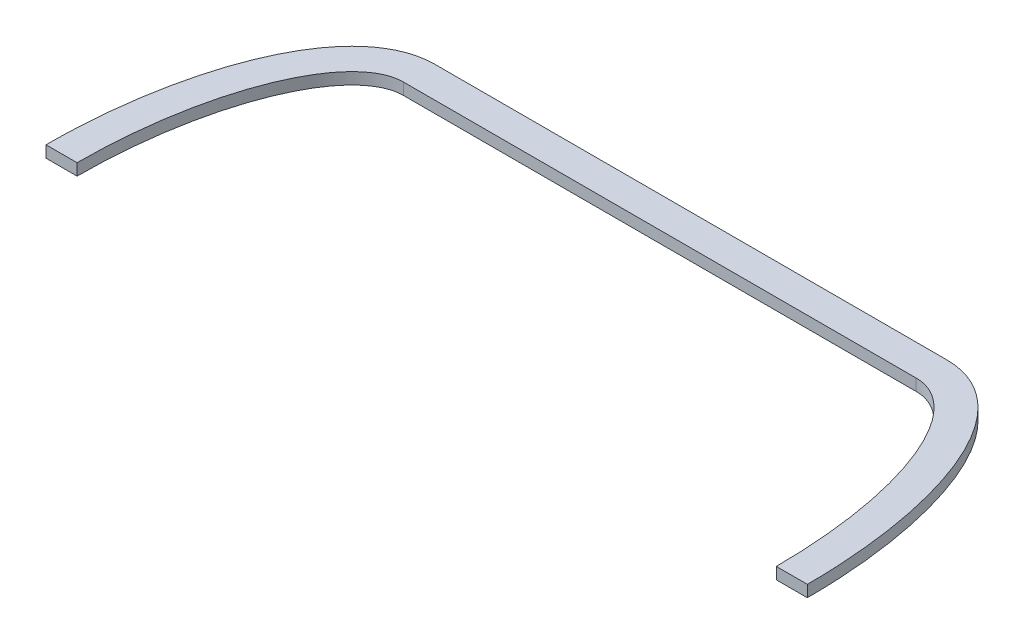
ISO-10303-21;
HEADER;
FILE_DESCRIPTION(('STEP AP214'),'2;1');
FILE_NAME('part.step','',(''),(''),'','','');
FILE_SCHEMA(('AUTOMOTIVE_DESIGN { 1 0 10303 214 1 1 1 1 }'));
ENDSEC;
DATA;
#1=APPLICATION_CONTEXT('core data for automotive mechanical design processes');
#2=APPLICATION_PROTOCOL_DEFINITION('international standard','automotive_design',2000,#1);
#3=PRODUCT_CONTEXT('',#1,'mechanical');
#4=PRODUCT('Part','Part','',(#3));
#5=PRODUCT_RELATED_PRODUCT_CATEGORY('part','',(#4));
#6=PRODUCT_DEFINITION_FORMATION('','',#4);
#7=PRODUCT_DEFINITION_CONTEXT('part definition',#1,'design');
#8=PRODUCT_DEFINITION('design','',#6,#7);
#9=PRODUCT_DEFINITION_SHAPE('','',#8);
#10=(LENGTH_UNIT() NAMED_UNIT(*) SI_UNIT(.MILLI.,.METRE.));
#11=(NAMED_UNIT(*) PLANE_ANGLE_UNIT() SI_UNIT($,.RADIAN.));
#12=(NAMED_UNIT(*) SI_UNIT($,.STERADIAN.) SOLID_ANGLE_UNIT());
#13=UNCERTAINTY_MEASURE_WITH_UNIT(LENGTH_MEASURE(1.E-05),#10,'distance_accuracy_value','');
#14=(GEOMETRIC_REPRESENTATION_CONTEXT(3) GLOBAL_UNCERTAINTY_ASSIGNED_CONTEXT((#13)) GLOBAL_UNIT_ASSIGNED_CONTEXT((#10,
#11,#12)) REPRESENTATION_CONTEXT('',''));
#15=CARTESIAN_POINT('',(0.,0.,0.));
#16=DIRECTION('',(0.,0.,1.));
#17=DIRECTION('',(1.,0.,0.));
#18=AXIS2_PLACEMENT_3D('',#15,#16,#17);
#19=CARTESIAN_POINT('',(-33.,1.5,0.));
#20=DIRECTION('',(0.,1.,0.));
#21=DIRECTION('',(0.,0.,1.));
#22=AXIS2_PLACEMENT_3D('',#19,#20,#21);
#23=ELLIPSE('',#22,30.,12.);
#24=DIRECTION('',(0.,-1.,0.));
#25=VECTOR('',#24,1.);
#26=SURFACE_OF_LINEAR_EXTRUSION('',#23,#25);
#27=OFFSET_SURFACE('',#26,-4.,.F.);
#28=DIRECTION('',(0.,-1.,0.));
#29=VECTOR('',#28,1.);
#30=CARTESIAN_POINT('',(-49.,0.75,0.));
#31=LINE('',#30,#29);
#32=CARTESIAN_POINT('',(-49.,1.5,0.));
#33=VERTEX_POINT('',#32);
#34=CARTESIAN_POINT('',(-49.,0.,0.));
#35=VERTEX_POINT('',#34);
#36=EDGE_CURVE('E116',#33,#35,#31,.T.);
#37=ORIENTED_EDGE('',*,*,#36,.F.);
#38=CARTESIAN_POINT('',(-33.,1.5,-34.));
#39=CARTESIAN_POINT('',(-33.1318594620977,1.5,-34.0000020599482));
#40=CARTESIAN_POINT('',(-33.2637006242787,1.5,-33.9970355341147));
#41=CARTESIAN_POINT('',(-33.5271110870535,1.5,-33.9851930390177));
#42=CARTESIAN_POINT('',(-33.6586804003457,1.5,-33.9763173523343));
#43=CARTESIAN_POINT('',(-34.0524260475535,1.5,-33.9408875606357));
#44=CARTESIAN_POINT('',(-34.3138623381053,1.5,-33.9055306264686));
#45=CARTESIAN_POINT('',(-34.8305964091808,1.5,-33.8123523725608));
#46=CARTESIAN_POINT('',(-35.0859257064015,1.5,-33.7547034487541));
#47=CARTESIAN_POINT('',(-35.5907917224365,1.5,-33.6179530744078));
#48=CARTESIAN_POINT('',(-35.8403278339926,1.5,-33.5388493858422));
#49=CARTESIAN_POINT('',(-36.3314711921855,1.5,-33.3607489952492));
#50=CARTESIAN_POINT('',(-36.573096455771,1.5,-33.2618017754368));
#51=CARTESIAN_POINT('',(-37.0479953394521,1.5,-33.0453975077983));
#52=CARTESIAN_POINT('',(-37.2812656129938,1.5,-32.9279331425494));
#53=CARTESIAN_POINT('',(-37.7388156571645,1.5,-32.6760332027823));
#54=CARTESIAN_POINT('',(-37.9630835644682,1.5,-32.5415761440126));
#55=CARTESIAN_POINT('',(-38.4018347424355,1.5,-32.2575102434145));
#56=CARTESIAN_POINT('',(-38.6163154961852,1.5,-32.1078975355798));
#57=CARTESIAN_POINT('',(-39.1532543402919,1.5,-31.7071041076178));
#58=CARTESIAN_POINT('',(-39.4684770078507,1.5,-31.4461846903361));
#59=CARTESIAN_POINT('',(-40.0745432389481,1.5,-30.8974107755337));
#60=CARTESIAN_POINT('',(-40.3653740258298,1.5,-30.6095423269061));
#61=CARTESIAN_POINT('',(-40.924294013386,1.5,-30.0114514760985));
#62=CARTESIAN_POINT('',(-41.1923320370166,1.5,-29.701181518627));
#63=CARTESIAN_POINT('',(-41.7066164563929,1.5,-29.0630483204643));
#64=CARTESIAN_POINT('',(-41.9528563480091,1.5,-28.7351798752964));
#65=CARTESIAN_POINT('',(-42.4712972529298,1.5,-28.0000642978313));
#66=CARTESIAN_POINT('',(-42.7392063418082,1.5,-27.5897993430692));
#67=CARTESIAN_POINT('',(-43.2494781947508,1.5,-26.7534139120122));
#68=CARTESIAN_POINT('',(-43.4918229407119,1.5,-26.3272825352882));
#69=CARTESIAN_POINT('',(-43.9535344011357,1.5,-25.4626566854945));
#70=CARTESIAN_POINT('',(-44.1728945430332,1.5,-25.0241587213834));
#71=CARTESIAN_POINT('',(-44.59130669948,1.5,-24.1366034231867));
#72=CARTESIAN_POINT('',(-44.7903190489005,1.5,-23.6875274883149));
#73=CARTESIAN_POINT('',(-45.1694966695557,1.5,-22.7817322494237));
#74=CARTESIAN_POINT('',(-45.3496694061485,1.5,-22.3250160567792));
#75=CARTESIAN_POINT('',(-45.6929528702929,1.5,-21.4052442104853));
#76=CARTESIAN_POINT('',(-45.856063669406,1.5,-20.942188583434));
#77=CARTESIAN_POINT('',(-46.1764891399855,1.5,-19.9813818243689));
#78=CARTESIAN_POINT('',(-46.3327822108289,1.5,-19.483290910703));
#79=CARTESIAN_POINT('',(-46.6291342184352,1.5,-18.4822739248874));
#80=CARTESIAN_POINT('',(-46.7691917170414,1.5,-17.9793474286655));
#81=CARTESIAN_POINT('',(-47.0343446224069,1.5,-16.9691716008346));
#82=CARTESIAN_POINT('',(-47.1594286517896,1.5,-16.461919291893));
#83=CARTESIAN_POINT('',(-47.3955073552352,1.5,-15.4441265624587));
#84=CARTESIAN_POINT('',(-47.5065012265865,1.5,-14.9335859563724));
#85=CARTESIAN_POINT('',(-47.7152506631777,1.5,-13.9096322212036));
#86=CARTESIAN_POINT('',(-47.8130017850487,1.5,-13.3962181878666));
#87=CARTESIAN_POINT('',(-47.9959021200888,1.5,-12.3671432744908));
#88=CARTESIAN_POINT('',(-48.0810508090306,1.5,-11.8514823019032));
#89=CARTESIAN_POINT('',(-48.3189822028628,1.5,-10.2983699369656));
#90=CARTESIAN_POINT('',(-48.453586223143,1.5,-9.25808852451466));
#91=CARTESIAN_POINT('',(-48.6777395263624,1.5,-7.17331636462823));
#92=CARTESIAN_POINT('',(-48.7673118072923,1.5,-6.12882804099582));
#93=CARTESIAN_POINT('',(-48.9035866922487,1.5,-4.03720573631824));
#94=CARTESIAN_POINT('',(-48.9502953565059,1.5,-2.99007215026959));
#95=CARTESIAN_POINT('',(-48.9979304608906,1.5,-1.05601569894444));
#96=CARTESIAN_POINT('',(-49.0047953518082,1.5,-0.169232157102556));
#97=CARTESIAN_POINT('',(-48.9886876788915,1.5,1.60419145579057));
#98=CARTESIAN_POINT('',(-48.9657111539563,1.5,2.49083149216792));
#99=CARTESIAN_POINT('',(-48.8895397901809,1.5,4.26308182212891));
#100=CARTESIAN_POINT('',(-48.8363359757705,1.5,5.14869173152721));
#101=CARTESIAN_POINT('',(-48.6987998662974,1.5,6.91798779564072));
#102=CARTESIAN_POINT('',(-48.614450737541,1.5,7.80167264959111));
#103=CARTESIAN_POINT('',(-48.4137441725008,1.5,9.56055225063439));
#104=CARTESIAN_POINT('',(-48.2975634838848,1.5,10.4357670281672));
#105=CARTESIAN_POINT('',(-48.0309519792693,1.5,12.1808466106661));
#106=CARTESIAN_POINT('',(-47.8805265524154,1.5,13.0507122353385));
#107=CARTESIAN_POINT('',(-47.5426449389393,1.5,14.7826673737946));
#108=CARTESIAN_POINT('',(-47.3552157164466,1.5,15.644762074639));
#109=CARTESIAN_POINT('',(-47.0433430253094,1.5,16.9300967030071));
#110=CARTESIAN_POINT('',(-46.9343030574677,1.5,17.3571074332168));
#111=CARTESIAN_POINT('',(-46.705323876174,1.5,18.2081897849636));
#112=CARTESIAN_POINT('',(-46.5853850963297,1.5,18.6322615227062));
#113=CARTESIAN_POINT('',(-46.3099613701162,1.5,19.5572920151293));
#114=CARTESIAN_POINT('',(-46.1520544438863,1.5,20.057533520389));
#115=CARTESIAN_POINT('',(-45.8183166797773,1.5,21.0519989533086));
#116=CARTESIAN_POINT('',(-45.642486626955,1.5,21.5462231434742));
#117=CARTESIAN_POINT('',(-45.2708565317141,1.5,22.5279730394365));
#118=CARTESIAN_POINT('',(-45.0750274579593,1.5,23.0154878072719));
#119=CARTESIAN_POINT('',(-44.661479868201,1.5,23.9811878173337));
#120=CARTESIAN_POINT('',(-44.44376152471,1.5,24.4593731330514));
#121=CARTESIAN_POINT('',(-43.981992283357,1.5,25.4077760171269));
#122=CARTESIAN_POINT('',(-43.7377404767102,1.5,25.8778963596938));
#123=CARTESIAN_POINT('',(-43.2212194112808,1.5,26.8027348642167));
#124=CARTESIAN_POINT('',(-42.9489444140762,1.5,27.2574498461149));
#125=CARTESIAN_POINT('',(-42.3735126923934,1.5,28.1456018489968));
#126=CARTESIAN_POINT('',(-42.0704261602621,1.5,28.5790840418468));
#127=CARTESIAN_POINT('',(-41.4291529915261,1.5,29.4192156910943));
#128=CARTESIAN_POINT('',(-41.0909897691264,1.5,29.8258827541572));
#129=CARTESIAN_POINT('',(-40.5278308199835,1.5,30.4385851206157));
#130=CARTESIAN_POINT('',(-40.3157240969554,1.5,30.6565141601795));
#131=CARTESIAN_POINT('',(-39.878127855667,1.5,31.0786383339111));
#132=CARTESIAN_POINT('',(-39.6526365904152,1.5,31.2828316677996));
#133=CARTESIAN_POINT('',(-39.1879603805882,1.5,31.6751775758266));
#134=CARTESIAN_POINT('',(-38.9487721248127,1.5,31.8633262436252));
#135=CARTESIAN_POINT('',(-38.4568919659684,1.5,32.2209113286117));
#136=CARTESIAN_POINT('',(-38.204205918611,1.5,32.390355763932));
#137=CARTESIAN_POINT('',(-37.6826037333005,1.5,32.7098471927893));
#138=CARTESIAN_POINT('',(-37.4135290937558,1.5,32.8596367230878));
#139=CARTESIAN_POINT('',(-36.8629856959038,1.5,33.1346097997704));
#140=CARTESIAN_POINT('',(-36.5815153949178,1.5,33.2597902728279));
#141=CARTESIAN_POINT('',(-36.0085391685868,1.5,33.4826454962346));
#142=CARTESIAN_POINT('',(-35.7170562164389,1.5,33.5803790342088));
#143=CARTESIAN_POINT('',(-35.125969633301,1.5,33.7463976127401));
#144=CARTESIAN_POINT('',(-34.8263712656585,1.5,33.8147012763248));
#145=CARTESIAN_POINT('',(-34.2725560161592,1.5,33.9114016006083));
#146=CARTESIAN_POINT('',(-34.0191717396856,1.5,33.9445750899428));
#147=CARTESIAN_POINT('',(-33.6377179083465,1.5,33.9778013169971));
#148=CARTESIAN_POINT('',(-33.5103278684717,1.5,33.986121061806));
#149=CARTESIAN_POINT('',(-33.2552966943805,1.5,33.9972218002038));
#150=CARTESIAN_POINT('',(-33.1276555410585,1.5,34.0000023546415));
#151=CARTESIAN_POINT('',(-33.,1.5,34.));
#152=B_SPLINE_CURVE_WITH_KNOTS('',3,(#38,#39,#40,#41,#42,#43,#44,#45,#46,#47,#48,#49,#50,#51,
#52,#53,#54,#55,#56,#57,#58,#59,#60,#61,#62,#63,#64,#65,#66,#67,#68,#69,#70,#71,#72,#73,#74,#75,
#76,#77,#78,#79,#80,#81,#82,#83,#84,#85,#86,#87,#88,#89,#90,#91,#92,#93,#94,#95,#96,#97,#98,#99,
#100,#101,#102,#103,#104,#105,#106,#107,#108,#109,#110,#111,#112,#113,#114,#115,#116,#117,#118,
#119,#120,#121,#122,#123,#124,#125,#126,#127,#128,#129,#130,#131,#132,#133,#134,#135,#136,#137,
#138,#139,#140,#141,#142,#143,#144,#145,#146,#147,#148,#149,#150,#151),.UNSPECIFIED.,.F.,.F.,(4,
2,2,2,2,2,2,2,2,2,2,2,2,2,2,2,2,2,2,2,2,2,2,2,2,2,2,2,2,2,2,2,2,2,2,2,2,2,2,2,2,2,2,2,2,2,2,2,2,
2,2,2,2,2,2,2,4),(0.,0.395508836014187,0.790998759870364,1.58131428167553,2.3656363114628,
3.15004018827493,3.93251185206918,4.71529350401624,5.49907493574531,6.28305680565762,
7.50867229476685,8.7349258126237,9.96386370828232,11.1931670672531,12.6620278715481,
14.1319171277453,15.6022255657429,17.0753476019005,18.5478836708645,20.0204135634422,
21.5862179857611,23.1521610021457,24.7192864253178,26.2865010870783,27.8542403042732,
29.4220447168738,32.5677400507569,35.7118272222425,38.8554698015129,41.5154187918589,
44.1757208955869,46.8368133519216,49.499346209299,52.147384676482,54.7950067056158,
57.4407065247341,58.7627261438731,60.0846931896487,61.6580971759044,63.231432274565,
64.8070846568383,66.3827246221411,67.9712586192657,69.5601185565721,71.1454367174265,
72.7297033832918,73.6415262024059,74.5534682982544,75.4656317913664,76.3774027270191,
77.3001263347647,78.2229651046637,79.1438119355043,80.0640752017713,80.8297204129566,
81.2125979873055,81.5955059152856),.UNSPECIFIED.);
#153=CARTESIAN_POINT('',(-33.,1.5,-34.));
#154=VERTEX_POINT('',#153);
#155=EDGE_CURVE('E125',#154,#33,#152,.T.);
#156=ORIENTED_EDGE('',*,*,#155,.F.);
#157=DIRECTION('',(0.,-1.,0.));
#158=VECTOR('',#157,1.);
#159=CARTESIAN_POINT('',(-33.,1.5,-34.));
#160=LINE('',#159,#158);
#161=CARTESIAN_POINT('',(-33.,0.,-34.));
#162=VERTEX_POINT('',#161);
#163=EDGE_CURVE('E171',#154,#162,#160,.T.);
#164=ORIENTED_EDGE('',*,*,#163,.T.);
#165=CARTESIAN_POINT('',(-33.,0.,-34.));
#166=CARTESIAN_POINT('',(-33.1318594620977,0.,-34.0000020599482));
#167=CARTESIAN_POINT('',(-33.2637006242787,0.,-33.9970355341147));
#168=CARTESIAN_POINT('',(-33.5271110870535,0.,-33.9851930390177));
#169=CARTESIAN_POINT('',(-33.6586804003457,0.,-33.9763173523343));
#170=CARTESIAN_POINT('',(-34.0524260475535,0.,-33.9408875606357));
#171=CARTESIAN_POINT('',(-34.3138623381053,0.,-33.9055306264686));
#172=CARTESIAN_POINT('',(-34.8305964091808,0.,-33.8123523725608));
#173=CARTESIAN_POINT('',(-35.0859257064015,0.,-33.7547034487541));
#174=CARTESIAN_POINT('',(-35.5907917224365,0.,-33.6179530744078));
#175=CARTESIAN_POINT('',(-35.8403278339926,0.,-33.5388493858422));
#176=CARTESIAN_POINT('',(-36.3314711921855,0.,-33.3607489952492));
#177=CARTESIAN_POINT('',(-36.573096455771,0.,-33.2618017754368));
#178=CARTESIAN_POINT('',(-37.0479953394521,0.,-33.0453975077983));
#179=CARTESIAN_POINT('',(-37.2812656129938,0.,-32.9279331425494));
#180=CARTESIAN_POINT('',(-37.7388156571645,0.,-32.6760332027823));
#181=CARTESIAN_POINT('',(-37.9630835644682,0.,-32.5415761440126));
#182=CARTESIAN_POINT('',(-38.4018347424355,0.,-32.2575102434145));
#183=CARTESIAN_POINT('',(-38.6163154961852,0.,-32.1078975355798));
#184=CARTESIAN_POINT('',(-39.1532543402919,0.,-31.7071041076178));
#185=CARTESIAN_POINT('',(-39.4684770078507,0.,-31.4461846903361));
#186=CARTESIAN_POINT('',(-40.0745432389481,0.,-30.8974107755337));
#187=CARTESIAN_POINT('',(-40.3653740258298,0.,-30.6095423269061));
#188=CARTESIAN_POINT('',(-40.924294013386,0.,-30.0114514760985));
#189=CARTESIAN_POINT('',(-41.1923320370166,0.,-29.701181518627));
#190=CARTESIAN_POINT('',(-41.7066164563929,0.,-29.0630483204643));
#191=CARTESIAN_POINT('',(-41.9528563480091,0.,-28.7351798752964));
#192=CARTESIAN_POINT('',(-42.4712972529298,0.,-28.0000642978313));
#193=CARTESIAN_POINT('',(-42.7392063418082,0.,-27.5897993430692));
#194=CARTESIAN_POINT('',(-43.2494781947508,0.,-26.7534139120122));
#195=CARTESIAN_POINT('',(-43.4918229407119,0.,-26.3272825352882));
#196=CARTESIAN_POINT('',(-43.9535344011357,0.,-25.4626566854945));
#197=CARTESIAN_POINT('',(-44.1728945430332,0.,-25.0241587213834));
#198=CARTESIAN_POINT('',(-44.59130669948,0.,-24.1366034231867));
#199=CARTESIAN_POINT('',(-44.7903190489005,0.,-23.6875274883149));
#200=CARTESIAN_POINT('',(-45.1694966695557,0.,-22.7817322494237));
#201=CARTESIAN_POINT('',(-45.3496694061485,0.,-22.3250160567792));
#202=CARTESIAN_POINT('',(-45.6929528702929,0.,-21.4052442104853));
#203=CARTESIAN_POINT('',(-45.856063669406,0.,-20.942188583434));
#204=CARTESIAN_POINT('',(-46.1764891399855,0.,-19.9813818243689));
#205=CARTESIAN_POINT('',(-46.3327822108289,0.,-19.483290910703));
#206=CARTESIAN_POINT('',(-46.6291342184352,0.,-18.4822739248874));
#207=CARTESIAN_POINT('',(-46.7691917170414,0.,-17.9793474286655));
#208=CARTESIAN_POINT('',(-47.0343446224069,0.,-16.9691716008346));
#209=CARTESIAN_POINT('',(-47.1594286517896,0.,-16.461919291893));
#210=CARTESIAN_POINT('',(-47.3955073552352,0.,-15.4441265624587));
#211=CARTESIAN_POINT('',(-47.5065012265865,0.,-14.9335859563724));
#212=CARTESIAN_POINT('',(-47.7152506631777,0.,-13.9096322212036));
#213=CARTESIAN_POINT('',(-47.8130017850487,0.,-13.3962181878666));
#214=CARTESIAN_POINT('',(-47.9959021200888,0.,-12.3671432744908));
#215=CARTESIAN_POINT('',(-48.0810508090306,0.,-11.8514823019032));
#216=CARTESIAN_POINT('',(-48.3189822028628,0.,-10.2983699369656));
#217=CARTESIAN_POINT('',(-48.453586223143,0.,-9.25808852451466));
#218=CARTESIAN_POINT('',(-48.6777395263624,0.,-7.17331636462823));
#219=CARTESIAN_POINT('',(-48.7673118072923,0.,-6.12882804099582));
#220=CARTESIAN_POINT('',(-48.9035866922487,0.,-4.03720573631824));
#221=CARTESIAN_POINT('',(-48.9502953565059,0.,-2.99007215026959));
#222=CARTESIAN_POINT('',(-48.9979304608906,0.,-1.05601569894444));
#223=CARTESIAN_POINT('',(-49.0047953518082,0.,-0.169232157102556));
#224=CARTESIAN_POINT('',(-48.9886876788915,0.,1.60419145579057));
#225=CARTESIAN_POINT('',(-48.9657111539563,0.,2.49083149216792));
#226=CARTESIAN_POINT('',(-48.8895397901809,0.,4.26308182212891));
#227=CARTESIAN_POINT('',(-48.8363359757705,0.,5.14869173152721));
#228=CARTESIAN_POINT('',(-48.6987998662974,0.,6.91798779564072));
#229=CARTESIAN_POINT('',(-48.614450737541,0.,7.80167264959111));
#230=CARTESIAN_POINT('',(-48.4137441725008,0.,9.56055225063439));
#231=CARTESIAN_POINT('',(-48.2975634838848,0.,10.4357670281672));
#232=CARTESIAN_POINT('',(-48.0309519792693,0.,12.1808466106661));
#233=CARTESIAN_POINT('',(-47.8805265524154,0.,13.0507122353385));
#234=CARTESIAN_POINT('',(-47.5426449389393,0.,14.7826673737946));
#235=CARTESIAN_POINT('',(-47.3552157164466,0.,15.644762074639));
#236=CARTESIAN_POINT('',(-47.0433430253094,0.,16.9300967030071));
#237=CARTESIAN_POINT('',(-46.9343030574677,0.,17.3571074332168));
#238=CARTESIAN_POINT('',(-46.705323876174,0.,18.2081897849636));
#239=CARTESIAN_POINT('',(-46.5853850963297,0.,18.6322615227062));
#240=CARTESIAN_POINT('',(-46.3099613701162,0.,19.5572920151293));
#241=CARTESIAN_POINT('',(-46.1520544438863,0.,20.057533520389));
#242=CARTESIAN_POINT('',(-45.8183166797773,0.,21.0519989533086));
#243=CARTESIAN_POINT('',(-45.642486626955,0.,21.5462231434742));
#244=CARTESIAN_POINT('',(-45.2708565317141,0.,22.5279730394365));
#245=CARTESIAN_POINT('',(-45.0750274579593,0.,23.0154878072719));
#246=CARTESIAN_POINT('',(-44.661479868201,0.,23.9811878173337));
#247=CARTESIAN_POINT('',(-44.44376152471,0.,24.4593731330514));
#248=CARTESIAN_POINT('',(-43.981992283357,0.,25.4077760171269));
#249=CARTESIAN_POINT('',(-43.7377404767102,0.,25.8778963596938));
#250=CARTESIAN_POINT('',(-43.2212194112808,0.,26.8027348642167));
#251=CARTESIAN_POINT('',(-42.9489444140762,0.,27.2574498461149));
#252=CARTESIAN_POINT('',(-42.3735126923934,0.,28.1456018489968));
#253=CARTESIAN_POINT('',(-42.0704261602621,0.,28.5790840418468));
#254=CARTESIAN_POINT('',(-41.4291529915261,0.,29.4192156910943));
#255=CARTESIAN_POINT('',(-41.0909897691264,0.,29.8258827541572));
#256=CARTESIAN_POINT('',(-40.5278308199835,0.,30.4385851206157));
#257=CARTESIAN_POINT('',(-40.3157240969554,0.,30.6565141601795));
#258=CARTESIAN_POINT('',(-39.878127855667,0.,31.0786383339111));
#259=CARTESIAN_POINT('',(-39.6526365904152,0.,31.2828316677996));
#260=CARTESIAN_POINT('',(-39.1879603805882,0.,31.6751775758266));
#261=CARTESIAN_POINT('',(-38.9487721248127,0.,31.8633262436252));
#262=CARTESIAN_POINT('',(-38.4568919659684,0.,32.2209113286117));
#263=CARTESIAN_POINT('',(-38.204205918611,0.,32.390355763932));
#264=CARTESIAN_POINT('',(-37.6826037333005,0.,32.7098471927893));
#265=CARTESIAN_POINT('',(-37.4135290937558,0.,32.8596367230878));
#266=CARTESIAN_POINT('',(-36.8629856959038,0.,33.1346097997704));
#267=CARTESIAN_POINT('',(-36.5815153949178,0.,33.2597902728279));
#268=CARTESIAN_POINT('',(-36.0085391685868,0.,33.4826454962346));
#269=CARTESIAN_POINT('',(-35.7170562164389,0.,33.5803790342088));
#270=CARTESIAN_POINT('',(-35.125969633301,0.,33.7463976127401));
#271=CARTESIAN_POINT('',(-34.8263712656585,0.,33.8147012763248));
#272=CARTESIAN_POINT('',(-34.2725560161592,0.,33.9114016006083));
#273=CARTESIAN_POINT('',(-34.0191717396856,0.,33.9445750899428));
#274=CARTESIAN_POINT('',(-33.6377179083465,0.,33.9778013169971));
#275=CARTESIAN_POINT('',(-33.5103278684717,0.,33.986121061806));
#276=CARTESIAN_POINT('',(-33.2552966943805,0.,33.9972218002038));
#277=CARTESIAN_POINT('',(-33.1276555410585,0.,34.0000023546415));
#278=CARTESIAN_POINT('',(-33.,0.,34.));
#279=B_SPLINE_CURVE_WITH_KNOTS('',3,(#165,#166,#167,#168,#169,#170,#171,#172,#173,#174,#175,
#176,#177,#178,#179,#180,#181,#182,#183,#184,#185,#186,#187,#188,#189,#190,#191,#192,#193,#194,
#195,#196,#197,#198,#199,#200,#201,#202,#203,#204,#205,#206,#207,#208,#209,#210,#211,#212,#213,
#214,#215,#216,#217,#218,#219,#220,#221,#222,#223,#224,#225,#226,#227,#228,#229,#230,#231,#232,
#233,#234,#235,#236,#237,#238,#239,#240,#241,#242,#243,#244,#245,#246,#247,#248,#249,#250,#251,
#252,#253,#254,#255,#256,#257,#258,#259,#260,#261,#262,#263,#264,#265,#266,#267,#268,#269,#270,
#271,#272,#273,#274,#275,#276,#277,#278),.UNSPECIFIED.,.F.,.F.,(4,2,2,2,2,2,2,2,2,2,2,2,2,2,2,2,
2,2,2,2,2,2,2,2,2,2,2,2,2,2,2,2,2,2,2,2,2,2,2,2,2,2,2,2,2,2,2,2,2,2,2,2,2,2,2,2,4),(0.,
0.395508836014187,0.790998759870364,1.58131428167553,2.3656363114628,3.15004018827493,
3.93251185206918,4.71529350401624,5.49907493574531,6.28305680565762,7.50867229476685,
8.7349258126237,9.96386370828232,11.1931670672531,12.6620278715481,14.1319171277453,
15.6022255657429,17.0753476019005,18.5478836708645,20.0204135634422,21.5862179857611,
23.1521610021457,24.7192864253178,26.2865010870783,27.8542403042732,29.4220447168738,
32.5677400507569,35.7118272222425,38.8554698015129,41.5154187918589,44.1757208955869,
46.8368133519216,49.499346209299,52.147384676482,54.7950067056158,57.4407065247341,
58.7627261438731,60.0846931896487,61.6580971759044,63.231432274565,64.8070846568383,
66.3827246221411,67.9712586192657,69.5601185565721,71.1454367174265,72.7297033832918,
73.6415262024059,74.5534682982544,75.4656317913664,76.3774027270191,77.3001263347647,
78.2229651046637,79.1438119355043,80.0640752017713,80.8297204129566,81.2125979873055,
81.5955059152856),.UNSPECIFIED.);
#280=EDGE_CURVE('E123',#162,#35,#279,.T.);
#281=ORIENTED_EDGE('',*,*,#280,.T.);
#282=EDGE_LOOP('',(#37,#156,#164,#281));
#283=FACE_BOUND('',#282,.T.);
#284=ADVANCED_FACE('F36',(#283),#27,.F.);
#285=CARTESIAN_POINT('',(33.,1.5,0.));
#286=DIRECTION('',(0.,-1.,0.));
#287=DIRECTION('',(0.,0.,1.));
#288=AXIS2_PLACEMENT_3D('',#285,#286,#287);
#289=ELLIPSE('',#288,30.,12.);
#290=DIRECTION('',(0.,-1.,0.));
#291=VECTOR('',#290,1.);
#292=SURFACE_OF_LINEAR_EXTRUSION('',#289,#291);
#293=OFFSET_SURFACE('',#292,4.,.F.);
#294=CARTESIAN_POINT('',(33.,1.5,-34.));
#295=CARTESIAN_POINT('',(33.1318594620977,1.5,-34.0000020599482));
#296=CARTESIAN_POINT('',(33.2637006242787,1.5,-33.9970355341147));
#297=CARTESIAN_POINT('',(33.5271110870536,1.5,-33.9851930390177));
#298=CARTESIAN_POINT('',(33.6586804003457,1.5,-33.9763173523343));
#299=CARTESIAN_POINT('',(34.0524260475535,1.5,-33.9408875606357));
#300=CARTESIAN_POINT('',(34.3138623381053,1.5,-33.9055306264686));
#301=CARTESIAN_POINT('',(34.8305964091809,1.5,-33.8123523725608));
#302=CARTESIAN_POINT('',(35.0859257064015,1.5,-33.7547034487541));
#303=CARTESIAN_POINT('',(35.5907917224366,1.5,-33.6179530744078));
#304=CARTESIAN_POINT('',(35.8403278339927,1.5,-33.5388493858422));
#305=CARTESIAN_POINT('',(36.3314711921855,1.5,-33.3607489952492));
#306=CARTESIAN_POINT('',(36.573096455771,1.5,-33.2618017754368));
#307=CARTESIAN_POINT('',(37.0479953394522,1.5,-33.0453975077983));
#308=CARTESIAN_POINT('',(37.2812656129938,1.5,-32.9279331425494));
#309=CARTESIAN_POINT('',(37.7388156571646,1.5,-32.6760332027822));
#310=CARTESIAN_POINT('',(37.9630835644682,1.5,-32.5415761440126));
#311=CARTESIAN_POINT('',(38.4018347424356,1.5,-32.2575102434144));
#312=CARTESIAN_POINT('',(38.6163154961852,1.5,-32.1078975355798));
#313=CARTESIAN_POINT('',(39.1532543402919,1.5,-31.7071041076178));
#314=CARTESIAN_POINT('',(39.4684770078507,1.5,-31.446184690336));
#315=CARTESIAN_POINT('',(40.0745432389481,1.5,-30.8974107755336));
#316=CARTESIAN_POINT('',(40.3653740258299,1.5,-30.6095423269061));
#317=CARTESIAN_POINT('',(40.9242940133861,1.5,-30.0114514760985));
#318=CARTESIAN_POINT('',(41.1923320370166,1.5,-29.7011815186269));
#319=CARTESIAN_POINT('',(41.706616456393,1.5,-29.0630483204643));
#320=CARTESIAN_POINT('',(41.9528563480091,1.5,-28.7351798752963));
#321=CARTESIAN_POINT('',(42.4712972529298,1.5,-28.0000642978313));
#322=CARTESIAN_POINT('',(42.7392063418083,1.5,-27.5897993430691));
#323=CARTESIAN_POINT('',(43.2494781947508,1.5,-26.7534139120122));
#324=CARTESIAN_POINT('',(43.4918229407119,1.5,-26.3272825352881));
#325=CARTESIAN_POINT('',(43.9535344011357,1.5,-25.4626566854944));
#326=CARTESIAN_POINT('',(44.1728945430332,1.5,-25.0241587213833));
#327=CARTESIAN_POINT('',(44.5913066994801,1.5,-24.1366034231866));
#328=CARTESIAN_POINT('',(44.7903190489005,1.5,-23.6875274883148));
#329=CARTESIAN_POINT('',(45.1694966695558,1.5,-22.7817322494236));
#330=CARTESIAN_POINT('',(45.3496694061486,1.5,-22.3250160567791));
#331=CARTESIAN_POINT('',(45.692952870293,1.5,-21.4052442104852));
#332=CARTESIAN_POINT('',(45.8560636694061,1.5,-20.9421885834339));
#333=CARTESIAN_POINT('',(46.1764891399856,1.5,-19.9813818243687));
#334=CARTESIAN_POINT('',(46.332782210829,1.5,-19.4832909107029));
#335=CARTESIAN_POINT('',(46.6291342184352,1.5,-18.4822739248873));
#336=CARTESIAN_POINT('',(46.7691917170415,1.5,-17.9793474286653));
#337=CARTESIAN_POINT('',(47.034344622407,1.5,-16.9691716008345));
#338=CARTESIAN_POINT('',(47.1594286517897,1.5,-16.4619192918928));
#339=CARTESIAN_POINT('',(47.3955073552353,1.5,-15.4441265624586));
#340=CARTESIAN_POINT('',(47.5065012265866,1.5,-14.9335859563722));
#341=CARTESIAN_POINT('',(47.7152506631777,1.5,-13.9096322212035));
#342=CARTESIAN_POINT('',(47.8130017850488,1.5,-13.3962181878665));
#343=CARTESIAN_POINT('',(47.9959021200888,1.5,-12.3671432744906));
#344=CARTESIAN_POINT('',(48.0810508090306,1.5,-11.851482301903));
#345=CARTESIAN_POINT('',(48.3189822028629,1.5,-10.2983699369654));
#346=CARTESIAN_POINT('',(48.453586223143,1.5,-9.25808852451447));
#347=CARTESIAN_POINT('',(48.6777395263624,1.5,-7.17331636462802));
#348=CARTESIAN_POINT('',(48.7673118072923,1.5,-6.12882804099561));
#349=CARTESIAN_POINT('',(48.9035866922487,1.5,-4.03720573631802));
#350=CARTESIAN_POINT('',(48.9502953565059,1.5,-2.99007215026935));
#351=CARTESIAN_POINT('',(48.9979304608906,1.5,-1.0560156989442));
#352=CARTESIAN_POINT('',(49.0047953518082,1.5,-0.169232157102302));
#353=CARTESIAN_POINT('',(48.9886876788915,1.5,1.60419145579083));
#354=CARTESIAN_POINT('',(48.9657111539563,1.5,2.4908314921682));
#355=CARTESIAN_POINT('',(48.8895397901809,1.5,4.26308182212921));
#356=CARTESIAN_POINT('',(48.8363359757705,1.5,5.1486917315275));
#357=CARTESIAN_POINT('',(48.6987998662973,1.5,6.91798779564103));
#358=CARTESIAN_POINT('',(48.614450737541,1.5,7.80167264959143));
#359=CARTESIAN_POINT('',(48.4137441725008,1.5,9.56055225063472));
#360=CARTESIAN_POINT('',(48.2975634838848,1.5,10.4357670281675));
#361=CARTESIAN_POINT('',(48.0309519792692,1.5,12.1808466106664));
#362=CARTESIAN_POINT('',(47.8805265524154,1.5,13.0507122353389));
#363=CARTESIAN_POINT('',(47.5426449389392,1.5,14.782667373795));
#364=CARTESIAN_POINT('',(47.3552157164465,1.5,15.6447620746394));
#365=CARTESIAN_POINT('',(47.0433430253093,1.5,16.9300967030075));
#366=CARTESIAN_POINT('',(46.9343030574676,1.5,17.3571074332172));
#367=CARTESIAN_POINT('',(46.7053238761739,1.5,18.208189784964));
#368=CARTESIAN_POINT('',(46.5853850963296,1.5,18.6322615227066));
#369=CARTESIAN_POINT('',(46.3099613701161,1.5,19.5572920151297));
#370=CARTESIAN_POINT('',(46.1520544438862,1.5,20.0575335203894));
#371=CARTESIAN_POINT('',(45.8183166797772,1.5,21.0519989533089));
#372=CARTESIAN_POINT('',(45.6424866269549,1.5,21.5462231434745));
#373=CARTESIAN_POINT('',(45.270856531714,1.5,22.5279730394369));
#374=CARTESIAN_POINT('',(45.0750274579591,1.5,23.0154878072722));
#375=CARTESIAN_POINT('',(44.6614798682008,1.5,23.981187817334));
#376=CARTESIAN_POINT('',(44.4437615247099,1.5,24.4593731330517));
#377=CARTESIAN_POINT('',(43.9819922833569,1.5,25.4077760171272));
#378=CARTESIAN_POINT('',(43.7377404767101,1.5,25.8778963596941));
#379=CARTESIAN_POINT('',(43.2212194112807,1.5,26.802734864217));
#380=CARTESIAN_POINT('',(42.9489444140761,1.5,27.2574498461151));
#381=CARTESIAN_POINT('',(42.3735126923932,1.5,28.145601848997));
#382=CARTESIAN_POINT('',(42.0704261602619,1.5,28.579084041847));
#383=CARTESIAN_POINT('',(41.429152991526,1.5,29.4192156910945));
#384=CARTESIAN_POINT('',(41.0909897691263,1.5,29.8258827541573));
#385=CARTESIAN_POINT('',(40.5278308199834,1.5,30.4385851206158));
#386=CARTESIAN_POINT('',(40.3157240969553,1.5,30.6565141601796));
#387=CARTESIAN_POINT('',(39.8781278556668,1.5,31.0786383339112));
#388=CARTESIAN_POINT('',(39.6526365904151,1.5,31.2828316677998));
#389=CARTESIAN_POINT('',(39.1879603805881,1.5,31.6751775758267));
#390=CARTESIAN_POINT('',(38.9487721248125,1.5,31.8633262436253));
#391=CARTESIAN_POINT('',(38.4568919659683,1.5,32.2209113286118));
#392=CARTESIAN_POINT('',(38.2042059186109,1.5,32.390355763932));
#393=CARTESIAN_POINT('',(37.6826037333004,1.5,32.7098471927894));
#394=CARTESIAN_POINT('',(37.4135290937557,1.5,32.8596367230879));
#395=CARTESIAN_POINT('',(36.8629856959037,1.5,33.1346097997705));
#396=CARTESIAN_POINT('',(36.5815153949177,1.5,33.259790272828));
#397=CARTESIAN_POINT('',(36.0085391685867,1.5,33.4826454962346));
#398=CARTESIAN_POINT('',(35.7170562164388,1.5,33.5803790342089));
#399=CARTESIAN_POINT('',(35.1259696333009,1.5,33.7463976127401));
#400=CARTESIAN_POINT('',(34.8263712656584,1.5,33.8147012763248));
#401=CARTESIAN_POINT('',(34.2725560161592,1.5,33.9114016006083));
#402=CARTESIAN_POINT('',(34.0191717396855,1.5,33.9445750899428));
#403=CARTESIAN_POINT('',(33.6377179083464,1.5,33.9778013169971));
#404=CARTESIAN_POINT('',(33.5103278684717,1.5,33.986121061806));
#405=CARTESIAN_POINT('',(33.2552966943805,1.5,33.9972218002038));
#406=CARTESIAN_POINT('',(33.1276555410585,1.5,34.0000023546415));
#407=CARTESIAN_POINT('',(33.,1.5,34.));
#408=B_SPLINE_CURVE_WITH_KNOTS('',3,(#294,#295,#296,#297,#298,#299,#300,#301,#302,#303,#304,
#305,#306,#307,#308,#309,#310,#311,#312,#313,#314,#315,#316,#317,#318,#319,#320,#321,#322,#323,
#324,#325,#326,#327,#328,#329,#330,#331,#332,#333,#334,#335,#336,#337,#338,#339,#340,#341,#342,
#343,#344,#345,#346,#347,#348,#349,#350,#351,#352,#353,#354,#355,#356,#357,#358,#359,#360,#361,
#362,#363,#364,#365,#366,#367,#368,#369,#370,#371,#372,#373,#374,#375,#376,#377,#378,#379,#380,
#381,#382,#383,#384,#385,#386,#387,#388,#389,#390,#391,#392,#393,#394,#395,#396,#397,#398,#399,
#400,#401,#402,#403,#404,#405,#406,#407),.UNSPECIFIED.,.F.,.F.,(4,2,2,2,2,2,2,2,2,2,2,2,2,2,2,2,
2,2,2,2,2,2,2,2,2,2,2,2,2,2,2,2,2,2,2,2,2,2,2,2,2,2,2,2,2,2,2,2,2,2,2,2,2,2,2,2,4),(0.,
0.395508836014194,0.790998759870364,1.58131428167553,2.3656363114628,3.15004018827493,
3.93251185206919,4.71529350401626,5.49907493574532,6.28305680565762,7.50867229476686,
8.73492581262373,9.96386370828235,11.1931670672532,12.6620278715481,14.1319171277453,
15.6022255657429,17.0753476019006,18.5478836708646,20.0204135634424,21.5862179857612,
23.1521610021458,24.719286425318,26.2865010870785,27.8542403042734,29.422044716874,
32.5677400507571,35.7118272222427,38.8554698015131,41.5154187918592,44.1757208955872,
46.8368133519219,49.4993462092993,52.1473846764823,54.7950067056161,57.4407065247345,
58.7627261438735,60.0846931896491,61.6580971759048,63.2314322745653,64.8070846568386,
66.3827246221414,67.9712586192659,69.5601185565723,71.1454367174267,72.729703383292,
73.6415262024061,74.5534682982545,75.4656317913666,76.3774027270192,77.3001263347648,
78.2229651046638,79.1438119355044,80.0640752017714,80.8297204129567,81.2125979873055,
81.5955059152856),.UNSPECIFIED.);
#409=CARTESIAN_POINT('',(33.,1.5,-34.));
#410=VERTEX_POINT('',#409);
#411=CARTESIAN_POINT('',(49.,1.5,0.));
#412=VERTEX_POINT('',#411);
#413=EDGE_CURVE('E115',#410,#412,#408,.T.);
#414=ORIENTED_EDGE('',*,*,#413,.T.);
#415=DIRECTION('',(0.,-1.,0.));
#416=VECTOR('',#415,1.);
#417=CARTESIAN_POINT('',(49.,0.75,0.));
#418=LINE('',#417,#416);
#419=CARTESIAN_POINT('',(49.,0.,0.));
#420=VERTEX_POINT('',#419);
#421=EDGE_CURVE('E101',#412,#420,#418,.T.);
#422=ORIENTED_EDGE('',*,*,#421,.T.);
#423=CARTESIAN_POINT('',(33.,0.,-34.));
#424=CARTESIAN_POINT('',(33.1318594620977,0.,-34.0000020599482));
#425=CARTESIAN_POINT('',(33.2637006242787,0.,-33.9970355341147));
#426=CARTESIAN_POINT('',(33.5271110870536,0.,-33.9851930390177));
#427=CARTESIAN_POINT('',(33.6586804003457,0.,-33.9763173523343));
#428=CARTESIAN_POINT('',(34.0524260475535,0.,-33.9408875606357));
#429=CARTESIAN_POINT('',(34.3138623381053,0.,-33.9055306264686));
#430=CARTESIAN_POINT('',(34.8305964091809,0.,-33.8123523725608));
#431=CARTESIAN_POINT('',(35.0859257064015,0.,-33.7547034487541));
#432=CARTESIAN_POINT('',(35.5907917224365,0.,-33.6179530744078));
#433=CARTESIAN_POINT('',(35.8403278339926,0.,-33.5388493858422));
#434=CARTESIAN_POINT('',(36.3314711921855,0.,-33.3607489952492));
#435=CARTESIAN_POINT('',(36.573096455771,0.,-33.2618017754368));
#436=CARTESIAN_POINT('',(37.0479953394521,0.,-33.0453975077983));
#437=CARTESIAN_POINT('',(37.2812656129938,0.,-32.9279331425494));
#438=CARTESIAN_POINT('',(37.7388156571646,0.,-32.6760332027823));
#439=CARTESIAN_POINT('',(37.9630835644682,0.,-32.5415761440126));
#440=CARTESIAN_POINT('',(38.4018347424355,0.,-32.2575102434145));
#441=CARTESIAN_POINT('',(38.6163154961852,0.,-32.1078975355798));
#442=CARTESIAN_POINT('',(39.1532543402919,0.,-31.7071041076179));
#443=CARTESIAN_POINT('',(39.4684770078507,0.,-31.4461846903361));
#444=CARTESIAN_POINT('',(40.0745432389481,0.,-30.8974107755337));
#445=CARTESIAN_POINT('',(40.3653740258299,0.,-30.6095423269061));
#446=CARTESIAN_POINT('',(40.924294013386,0.,-30.0114514760985));
#447=CARTESIAN_POINT('',(41.1923320370166,0.,-29.701181518627));
#448=CARTESIAN_POINT('',(41.7066164563929,0.,-29.0630483204643));
#449=CARTESIAN_POINT('',(41.9528563480091,0.,-28.7351798752964));
#450=CARTESIAN_POINT('',(42.4712972529298,0.,-28.0000642978313));
#451=CARTESIAN_POINT('',(42.7392063418082,0.,-27.5897993430692));
#452=CARTESIAN_POINT('',(43.2494781947508,0.,-26.7534139120122));
#453=CARTESIAN_POINT('',(43.4918229407119,0.,-26.3272825352882));
#454=CARTESIAN_POINT('',(43.9535344011357,0.,-25.4626566854945));
#455=CARTESIAN_POINT('',(44.1728945430332,0.,-25.0241587213833));
#456=CARTESIAN_POINT('',(44.59130669948,0.,-24.1366034231867));
#457=CARTESIAN_POINT('',(44.7903190489005,0.,-23.6875274883149));
#458=CARTESIAN_POINT('',(45.1694966695557,0.,-22.7817322494237));
#459=CARTESIAN_POINT('',(45.3496694061486,0.,-22.3250160567792));
#460=CARTESIAN_POINT('',(45.692952870293,0.,-21.4052442104853));
#461=CARTESIAN_POINT('',(45.856063669406,0.,-20.942188583434));
#462=CARTESIAN_POINT('',(46.1764891399855,0.,-19.9813818243688));
#463=CARTESIAN_POINT('',(46.3327822108289,0.,-19.483290910703));
#464=CARTESIAN_POINT('',(46.6291342184352,0.,-18.4822739248874));
#465=CARTESIAN_POINT('',(46.7691917170415,0.,-17.9793474286654));
#466=CARTESIAN_POINT('',(47.0343446224069,0.,-16.9691716008346));
#467=CARTESIAN_POINT('',(47.1594286517896,0.,-16.4619192918929));
#468=CARTESIAN_POINT('',(47.3955073552352,0.,-15.4441265624587));
#469=CARTESIAN_POINT('',(47.5065012265866,0.,-14.9335859563723));
#470=CARTESIAN_POINT('',(47.7152506631777,0.,-13.9096322212036));
#471=CARTESIAN_POINT('',(47.8130017850488,0.,-13.3962181878666));
#472=CARTESIAN_POINT('',(47.9959021200888,0.,-12.3671432744907));
#473=CARTESIAN_POINT('',(48.0810508090306,0.,-11.8514823019032));
#474=CARTESIAN_POINT('',(48.3189822028628,0.,-10.2983699369656));
#475=CARTESIAN_POINT('',(48.453586223143,0.,-9.25808852451462));
#476=CARTESIAN_POINT('',(48.6777395263624,0.,-7.17331636462818));
#477=CARTESIAN_POINT('',(48.7673118072923,0.,-6.12882804099578));
#478=CARTESIAN_POINT('',(48.9035866922487,0.,-4.0372057363182));
#479=CARTESIAN_POINT('',(48.9502953565059,0.,-2.99007215026955));
#480=CARTESIAN_POINT('',(48.9979304608906,0.,-1.0560156989444));
#481=CARTESIAN_POINT('',(49.0047953518082,0.,-0.169232157102506));
#482=CARTESIAN_POINT('',(48.9886876788916,0.,1.60419145579062));
#483=CARTESIAN_POINT('',(48.9657111539564,0.,2.49083149216798));
#484=CARTESIAN_POINT('',(48.8895397901809,0.,4.26308182212898));
#485=CARTESIAN_POINT('',(48.8363359757705,0.,5.14869173152728));
#486=CARTESIAN_POINT('',(48.6987998662973,0.,6.9179877956408));
#487=CARTESIAN_POINT('',(48.614450737541,0.,7.80167264959119));
#488=CARTESIAN_POINT('',(48.4137441725009,0.,9.56055225063447));
#489=CARTESIAN_POINT('',(48.2975634838848,0.,10.4357670281673));
#490=CARTESIAN_POINT('',(48.0309519792693,0.,12.1808466106661));
#491=CARTESIAN_POINT('',(47.8805265524154,0.,13.0507122353386));
#492=CARTESIAN_POINT('',(47.5426449389393,0.,14.7826673737947));
#493=CARTESIAN_POINT('',(47.3552157164466,0.,15.6447620746391));
#494=CARTESIAN_POINT('',(47.0433430253094,0.,16.9300967030072));
#495=CARTESIAN_POINT('',(46.9343030574677,0.,17.3571074332169));
#496=CARTESIAN_POINT('',(46.7053238761739,0.,18.2081897849637));
#497=CARTESIAN_POINT('',(46.5853850963297,0.,18.6322615227063));
#498=CARTESIAN_POINT('',(46.3099613701162,0.,19.5572920151294));
#499=CARTESIAN_POINT('',(46.1520544438863,0.,20.0575335203891));
#500=CARTESIAN_POINT('',(45.8183166797773,0.,21.0519989533087));
#501=CARTESIAN_POINT('',(45.642486626955,0.,21.5462231434743));
#502=CARTESIAN_POINT('',(45.2708565317141,0.,22.5279730394366));
#503=CARTESIAN_POINT('',(45.0750274579592,0.,23.015487807272));
#504=CARTESIAN_POINT('',(44.6614798682009,0.,23.9811878173337));
#505=CARTESIAN_POINT('',(44.44376152471,0.,24.4593731330515));
#506=CARTESIAN_POINT('',(43.981992283357,0.,25.407776017127));
#507=CARTESIAN_POINT('',(43.7377404767102,0.,25.8778963596939));
#508=CARTESIAN_POINT('',(43.2212194112808,0.,26.8027348642168));
#509=CARTESIAN_POINT('',(42.9489444140762,0.,27.2574498461149));
#510=CARTESIAN_POINT('',(42.3735126923933,0.,28.1456018489968));
#511=CARTESIAN_POINT('',(42.070426160262,0.,28.5790840418468));
#512=CARTESIAN_POINT('',(41.4291529915261,0.,29.4192156910944));
#513=CARTESIAN_POINT('',(41.0909897691264,0.,29.8258827541572));
#514=CARTESIAN_POINT('',(40.5278308199835,0.,30.4385851206157));
#515=CARTESIAN_POINT('',(40.3157240969554,0.,30.6565141601796));
#516=CARTESIAN_POINT('',(39.8781278556669,0.,31.0786383339112));
#517=CARTESIAN_POINT('',(39.6526365904152,0.,31.2828316677997));
#518=CARTESIAN_POINT('',(39.1879603805882,0.,31.6751775758266));
#519=CARTESIAN_POINT('',(38.9487721248126,0.,31.8633262436252));
#520=CARTESIAN_POINT('',(38.4568919659684,0.,32.2209113286118));
#521=CARTESIAN_POINT('',(38.204205918611,0.,32.390355763932));
#522=CARTESIAN_POINT('',(37.6826037333005,0.,32.7098471927894));
#523=CARTESIAN_POINT('',(37.4135290937558,0.,32.8596367230878));
#524=CARTESIAN_POINT('',(36.8629856959038,0.,33.1346097997704));
#525=CARTESIAN_POINT('',(36.5815153949178,0.,33.2597902728279));
#526=CARTESIAN_POINT('',(36.0085391685868,0.,33.4826454962346));
#527=CARTESIAN_POINT('',(35.7170562164389,0.,33.5803790342088));
#528=CARTESIAN_POINT('',(35.125969633301,0.,33.7463976127401));
#529=CARTESIAN_POINT('',(34.8263712656585,0.,33.8147012763247));
#530=CARTESIAN_POINT('',(34.2725560161592,0.,33.9114016006082));
#531=CARTESIAN_POINT('',(34.0191717396856,0.,33.9445750899428));
#532=CARTESIAN_POINT('',(33.6377179083465,0.,33.9778013169971));
#533=CARTESIAN_POINT('',(33.5103278684717,0.,33.9861210618059));
#534=CARTESIAN_POINT('',(33.2552966943805,0.,33.9972218002038));
#535=CARTESIAN_POINT('',(33.1276555410585,0.,34.0000023546415));
#536=CARTESIAN_POINT('',(33.,0.,34.));
#537=B_SPLINE_CURVE_WITH_KNOTS('',3,(#423,#424,#425,#426,#427,#428,#429,#430,#431,#432,#433,
#434,#435,#436,#437,#438,#439,#440,#441,#442,#443,#444,#445,#446,#447,#448,#449,#450,#451,#452,
#453,#454,#455,#456,#457,#458,#459,#460,#461,#462,#463,#464,#465,#466,#467,#468,#469,#470,#471,
#472,#473,#474,#475,#476,#477,#478,#479,#480,#481,#482,#483,#484,#485,#486,#487,#488,#489,#490,
#491,#492,#493,#494,#495,#496,#497,#498,#499,#500,#501,#502,#503,#504,#505,#506,#507,#508,#509,
#510,#511,#512,#513,#514,#515,#516,#517,#518,#519,#520,#521,#522,#523,#524,#525,#526,#527,#528,
#529,#530,#531,#532,#533,#534,#535,#536),.UNSPECIFIED.,.F.,.F.,(4,2,2,2,2,2,2,2,2,2,2,2,2,2,2,2,
2,2,2,2,2,2,2,2,2,2,2,2,2,2,2,2,2,2,2,2,2,2,2,2,2,2,2,2,2,2,2,2,2,2,2,2,2,2,2,2,4),(0.,
0.395508836014194,0.790998759870364,1.58131428167553,2.36563631146279,3.15004018827492,
3.93251185206917,4.71529350401624,5.4990749357453,6.2830568056576,7.50867229476684,
8.7349258126237,9.96386370828231,11.1931670672531,12.6620278715481,14.1319171277453,
15.6022255657429,17.0753476019006,18.5478836708646,20.0204135634423,21.5862179857611,
23.1521610021457,24.7192864253178,26.2865010870784,27.8542403042733,29.4220447168738,
32.567740050757,35.7118272222425,38.8554698015129,41.515418791859,44.175720895587,
46.8368133519217,49.4993462092991,52.147384676482,54.7950067056159,57.4407065247342,
58.7627261438732,60.0846931896488,61.6580971759046,63.2314322745651,64.8070846568384,
66.3827246221411,67.9712586192657,69.5601185565722,71.1454367174265,72.7297033832919,
73.641526202406,74.5534682982544,75.4656317913665,76.3774027270191,77.3001263347647,
78.2229651046638,79.1438119355044,80.0640752017713,80.8297204129567,81.2125979873055,
81.5955059152856),.UNSPECIFIED.);
#538=CARTESIAN_POINT('',(33.,0.,-34.));
#539=VERTEX_POINT('',#538);
#540=EDGE_CURVE('E112',#539,#420,#537,.T.);
#541=ORIENTED_EDGE('',*,*,#540,.F.);
#542=DIRECTION('',(0.,1.,0.));
#543=VECTOR('',#542,1.);
#544=CARTESIAN_POINT('',(33.,1.5,-34.));
#545=LINE('',#544,#543);
#546=EDGE_CURVE('E44',#410,#539,#545,.F.);
#547=ORIENTED_EDGE('',*,*,#546,.F.);
#548=EDGE_LOOP('',(#414,#422,#541,#547));
#549=FACE_BOUND('',#548,.T.);
#550=ADVANCED_FACE('F111',(#549),#293,.T.);
#551=CARTESIAN_POINT('',(-33.,1.5,0.));
#552=DIRECTION('',(0.,1.,0.));
#553=DIRECTION('',(0.,0.,1.));
#554=AXIS2_PLACEMENT_3D('',#551,#552,#553);
#555=PLANE('',#554);
#556=ORIENTED_EDGE('',*,*,#155,.T.);
#557=DIRECTION('',(-1.,0.,0.));
#558=VECTOR('',#557,1.);
#559=CARTESIAN_POINT('',(-53.1802581590242,1.5,0.));
#560=LINE('',#559,#558);
#561=CARTESIAN_POINT('',(-45.,1.5,0.));
#562=VERTEX_POINT('',#561);
#563=EDGE_CURVE('E106',#562,#33,#560,.T.);
#564=ORIENTED_EDGE('',*,*,#563,.F.);
#565=CARTESIAN_POINT('',(-33.,1.5,0.));
#566=DIRECTION('',(0.,1.,0.));
#567=DIRECTION('',(0.,0.,1.));
#568=AXIS2_PLACEMENT_3D('',#565,#566,#567);
#569=ELLIPSE('',#568,30.,12.);
#570=CARTESIAN_POINT('',(-33.,1.5,-30.));
#571=VERTEX_POINT('',#570);
#572=EDGE_CURVE('E194',#571,#562,#569,.T.);
#573=ORIENTED_EDGE('',*,*,#572,.F.);
#574=DIRECTION('',(1.,0.,0.));
#575=VECTOR('',#574,1.);
#576=CARTESIAN_POINT('',(-33.,1.5,-30.));
#577=LINE('',#576,#575);
#578=CARTESIAN_POINT('',(33.,1.5,-30.));
#579=VERTEX_POINT('',#578);
#580=EDGE_CURVE('E286',#571,#579,#577,.T.);
#581=ORIENTED_EDGE('',*,*,#580,.T.);
#582=CARTESIAN_POINT('',(33.,1.5,0.));
#583=DIRECTION('',(0.,-1.,0.));
#584=DIRECTION('',(0.,0.,1.));
#585=AXIS2_PLACEMENT_3D('',#582,#583,#584);
#586=ELLIPSE('',#585,30.,12.);
#587=CARTESIAN_POINT('',(45.,1.5,0.));
#588=VERTEX_POINT('',#587);
#589=EDGE_CURVE('E197',#579,#588,#586,.T.);
#590=ORIENTED_EDGE('',*,*,#589,.T.);
#591=EDGE_CURVE('E58',#412,#588,#560,.T.);
#592=ORIENTED_EDGE('',*,*,#591,.F.);
#593=ORIENTED_EDGE('',*,*,#413,.F.);
#594=DIRECTION('',(1.,0.,0.));
#595=VECTOR('',#594,1.);
#596=CARTESIAN_POINT('',(-33.,1.5,-34.));
#597=LINE('',#596,#595);
#598=EDGE_CURVE('E172',#154,#410,#597,.T.);
#599=ORIENTED_EDGE('',*,*,#598,.F.);
#600=EDGE_LOOP('',(#556,#564,#573,#581,#590,#592,#593,#599));
#601=FACE_BOUND('',#600,.T.);
#602=ADVANCED_FACE('F148',(#601),#555,.T.);
#603=CARTESIAN_POINT('',(-33.,0.,0.));
#604=DIRECTION('',(0.,1.,0.));
#605=DIRECTION('',(0.,0.,1.));
#606=AXIS2_PLACEMENT_3D('',#603,#604,#605);
#607=PLANE('',#606);
#608=DIRECTION('',(-1.,0.,0.));
#609=VECTOR('',#608,1.);
#610=CARTESIAN_POINT('',(-53.1802581590242,0.,0.));
#611=LINE('',#610,#609);
#612=CARTESIAN_POINT('',(-45.,0.,0.));
#613=VERTEX_POINT('',#612);
#614=EDGE_CURVE('E51',#613,#35,#611,.T.);
#615=ORIENTED_EDGE('',*,*,#614,.T.);
#616=ORIENTED_EDGE('',*,*,#280,.F.);
#617=DIRECTION('',(1.,0.,0.));
#618=VECTOR('',#617,1.);
#619=CARTESIAN_POINT('',(-33.,0.,-34.));
#620=LINE('',#619,#618);
#621=EDGE_CURVE('E122',#162,#539,#620,.T.);
#622=ORIENTED_EDGE('',*,*,#621,.T.);
#623=ORIENTED_EDGE('',*,*,#540,.T.);
#624=CARTESIAN_POINT('',(45.,0.,0.));
#625=VERTEX_POINT('',#624);
#626=EDGE_CURVE('E98',#420,#625,#611,.T.);
#627=ORIENTED_EDGE('',*,*,#626,.T.);
#628=CARTESIAN_POINT('',(33.,0.,0.));
#629=DIRECTION('',(0.,-1.,0.));
#630=DIRECTION('',(0.,0.,1.));
#631=AXIS2_PLACEMENT_3D('',#628,#629,#630);
#632=ELLIPSE('',#631,30.,12.);
#633=CARTESIAN_POINT('',(33.,0.,-30.));
#634=VERTEX_POINT('',#633);
#635=EDGE_CURVE('E190',#634,#625,#632,.T.);
#636=ORIENTED_EDGE('',*,*,#635,.F.);
#637=DIRECTION('',(1.,0.,0.));
#638=VECTOR('',#637,1.);
#639=CARTESIAN_POINT('',(-33.,0.,-30.));
#640=LINE('',#639,#638);
#641=CARTESIAN_POINT('',(-33.,0.,-30.));
#642=VERTEX_POINT('',#641);
#643=EDGE_CURVE('E198',#642,#634,#640,.T.);
#644=ORIENTED_EDGE('',*,*,#643,.F.);
#645=CARTESIAN_POINT('',(-33.,0.,0.));
#646=DIRECTION('',(0.,1.,0.));
#647=DIRECTION('',(0.,0.,1.));
#648=AXIS2_PLACEMENT_3D('',#645,#646,#647);
#649=ELLIPSE('',#648,30.,12.);
#650=EDGE_CURVE('E187',#642,#613,#649,.T.);
#651=ORIENTED_EDGE('',*,*,#650,.T.);
#652=EDGE_LOOP('',(#615,#616,#622,#623,#627,#636,#644,#651));
#653=FACE_BOUND('',#652,.T.);
#654=ADVANCED_FACE('F119',(#653),#607,.F.);
#655=DIRECTION('',(0.,-1.,0.));
#656=VECTOR('',#655,1.);
#657=SURFACE_OF_LINEAR_EXTRUSION('',#569,#656);
#658=ORIENTED_EDGE('',*,*,#572,.T.);
#659=DIRECTION('',(0.,-1.,0.));
#660=VECTOR('',#659,1.);
#661=CARTESIAN_POINT('',(-45.,1.5,0.));
#662=LINE('',#661,#660);
#663=EDGE_CURVE('E117',#562,#613,#662,.T.);
#664=ORIENTED_EDGE('',*,*,#663,.T.);
#665=ORIENTED_EDGE('',*,*,#650,.F.);
#666=DIRECTION('',(0.,-1.,0.));
#667=VECTOR('',#666,1.);
#668=CARTESIAN_POINT('',(-33.,1.5,-30.));
#669=LINE('',#668,#667);
#670=EDGE_CURVE('E284',#571,#642,#669,.T.);
#671=ORIENTED_EDGE('',*,*,#670,.F.);
#672=EDGE_LOOP('',(#658,#664,#665,#671));
#673=FACE_BOUND('',#672,.T.);
#674=ADVANCED_FACE('F147',(#673),#657,.T.);
#675=DIRECTION('',(0.,-1.,0.));
#676=VECTOR('',#675,1.);
#677=SURFACE_OF_LINEAR_EXTRUSION('',#586,#676);
#678=DIRECTION('',(0.,-1.,0.));
#679=VECTOR('',#678,1.);
#680=CARTESIAN_POINT('',(45.,1.5,0.));
#681=LINE('',#680,#679);
#682=EDGE_CURVE('E11',#588,#625,#681,.T.);
#683=ORIENTED_EDGE('',*,*,#682,.F.);
#684=ORIENTED_EDGE('',*,*,#589,.F.);
#685=DIRECTION('',(0.,-1.,0.));
#686=VECTOR('',#685,1.);
#687=CARTESIAN_POINT('',(33.,1.5,-30.));
#688=LINE('',#687,#686);
#689=EDGE_CURVE('E128',#579,#634,#688,.T.);
#690=ORIENTED_EDGE('',*,*,#689,.T.);
#691=ORIENTED_EDGE('',*,*,#635,.T.);
#692=EDGE_LOOP('',(#683,#684,#690,#691));
#693=FACE_BOUND('',#692,.T.);
#694=ADVANCED_FACE('F203',(#693),#677,.F.);
#695=CARTESIAN_POINT('',(-33.,1.5,-34.));
#696=DIRECTION('',(0.,0.,-1.));
#697=DIRECTION('',(-1.,0.,0.));
#698=AXIS2_PLACEMENT_3D('',#695,#696,#697);
#699=PLANE('',#698);
#700=ORIENTED_EDGE('',*,*,#621,.F.);
#701=ORIENTED_EDGE('',*,*,#163,.F.);
#702=ORIENTED_EDGE('',*,*,#598,.T.);
#703=ORIENTED_EDGE('',*,*,#546,.T.);
#704=EDGE_LOOP('',(#700,#701,#702,#703));
#705=FACE_BOUND('',#704,.T.);
#706=ADVANCED_FACE('F38',(#705),#699,.T.);
#707=CARTESIAN_POINT('',(-33.,1.5,-30.));
#708=DIRECTION('',(0.,0.,-1.));
#709=DIRECTION('',(-1.,0.,0.));
#710=AXIS2_PLACEMENT_3D('',#707,#708,#709);
#711=PLANE('',#710);
#712=ORIENTED_EDGE('',*,*,#643,.T.);
#713=ORIENTED_EDGE('',*,*,#689,.F.);
#714=ORIENTED_EDGE('',*,*,#580,.F.);
#715=ORIENTED_EDGE('',*,*,#670,.T.);
#716=EDGE_LOOP('',(#712,#713,#714,#715));
#717=FACE_BOUND('',#716,.T.);
#718=ADVANCED_FACE('F208',(#717),#711,.F.);
#719=CARTESIAN_POINT('',(-53.1802581590242,1.5,0.));
#720=DIRECTION('',(0.,0.,1.));
#721=DIRECTION('',(1.,0.,0.));
#722=AXIS2_PLACEMENT_3D('',#719,#720,#721);
#723=PLANE('',#722);
#724=ORIENTED_EDGE('',*,*,#591,.T.);
#725=ORIENTED_EDGE('',*,*,#682,.T.);
#726=ORIENTED_EDGE('',*,*,#626,.F.);
#727=ORIENTED_EDGE('',*,*,#421,.F.);
#728=EDGE_LOOP('',(#724,#725,#726,#727));
#729=FACE_BOUND('',#728,.T.);
#730=ADVANCED_FACE('F100',(#729),#723,.T.);
#731=ORIENTED_EDGE('',*,*,#36,.T.);
#732=ORIENTED_EDGE('',*,*,#614,.F.);
#733=ORIENTED_EDGE('',*,*,#663,.F.);
#734=ORIENTED_EDGE('',*,*,#563,.T.);
#735=EDGE_LOOP('',(#731,#732,#733,#734));
#736=FACE_BOUND('',#735,.T.);
#737=ADVANCED_FACE('F212',(#736),#723,.T.);
#738=CLOSED_SHELL('',(#284,#550,#602,#654,#674,#694,#706,#718,#730,#737));
#739=MANIFOLD_SOLID_BREP('B2',#738);
#740=ADVANCED_BREP_SHAPE_REPRESENTATION('',(#18,#739),#14);
#741=SHAPE_DEFINITION_REPRESENTATION(#9,#740);
ENDSEC;
END-ISO-10303-21;
